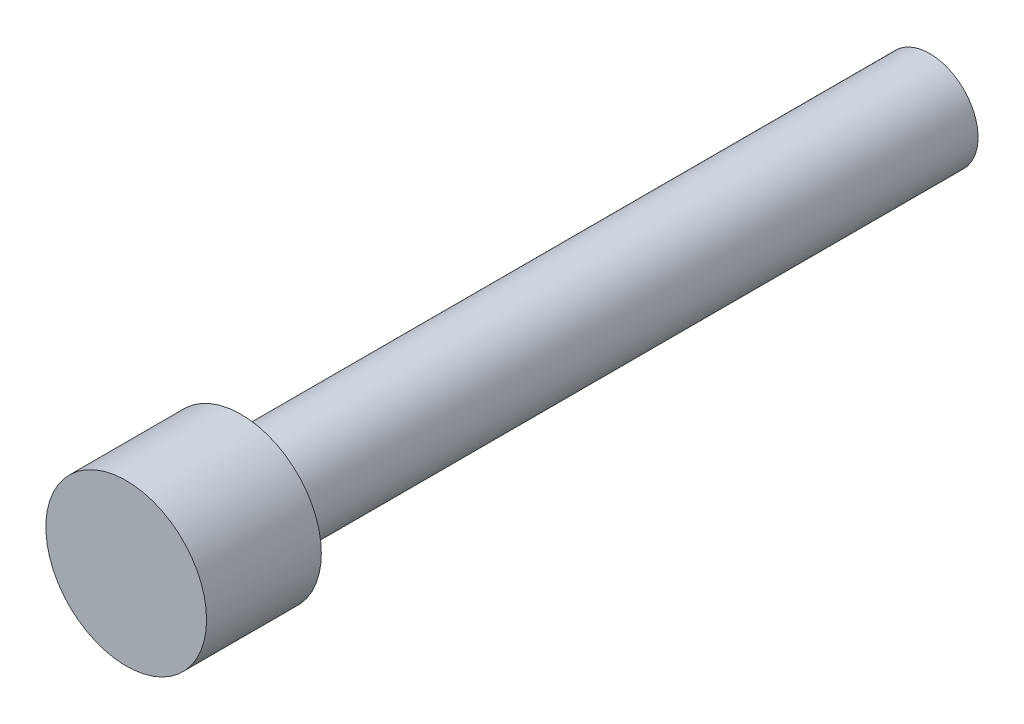
ISO-10303-21;
HEADER;
FILE_DESCRIPTION(('STEP AP214'),'2;1');
FILE_NAME('part.step','',(''),(''),'','','');
FILE_SCHEMA(('AUTOMOTIVE_DESIGN { 1 0 10303 214 1 1 1 1 }'));
ENDSEC;
DATA;
#1=APPLICATION_CONTEXT('core data for automotive mechanical design processes');
#2=APPLICATION_PROTOCOL_DEFINITION('international standard','automotive_design',2000,#1);
#3=PRODUCT_CONTEXT('',#1,'mechanical');
#4=PRODUCT('Part','Part','',(#3));
#5=PRODUCT_RELATED_PRODUCT_CATEGORY('part','',(#4));
#6=PRODUCT_DEFINITION_FORMATION('','',#4);
#7=PRODUCT_DEFINITION_CONTEXT('part definition',#1,'design');
#8=PRODUCT_DEFINITION('design','',#6,#7);
#9=PRODUCT_DEFINITION_SHAPE('','',#8);
#10=(LENGTH_UNIT() NAMED_UNIT(*) SI_UNIT(.MILLI.,.METRE.));
#11=(NAMED_UNIT(*) PLANE_ANGLE_UNIT() SI_UNIT($,.RADIAN.));
#12=(NAMED_UNIT(*) SI_UNIT($,.STERADIAN.) SOLID_ANGLE_UNIT());
#13=UNCERTAINTY_MEASURE_WITH_UNIT(LENGTH_MEASURE(1.E-05),#10,'distance_accuracy_value','');
#14=(GEOMETRIC_REPRESENTATION_CONTEXT(3) GLOBAL_UNCERTAINTY_ASSIGNED_CONTEXT((#13)) GLOBAL_UNIT_ASSIGNED_CONTEXT((#10,
#11,#12)) REPRESENTATION_CONTEXT('',''));
#15=CARTESIAN_POINT('',(0.,0.,0.));
#16=DIRECTION('',(0.,0.,1.));
#17=DIRECTION('',(1.,0.,0.));
#18=AXIS2_PLACEMENT_3D('',#15,#16,#17);
#19=CARTESIAN_POINT('',(0.,0.,19.05));
#20=DIRECTION('',(0.,0.,-1.));
#21=DIRECTION('',(-1.,0.,0.));
#22=AXIS2_PLACEMENT_3D('',#19,#20,#21);
#23=CYLINDRICAL_SURFACE('',#22,1.337499992);
#24=CARTESIAN_POINT('',(0.,0.,19.05));
#25=DIRECTION('',(0.,0.,1.));
#26=DIRECTION('',(1.,0.,0.));
#27=AXIS2_PLACEMENT_3D('',#24,#25,#26);
#28=CIRCLE('',#27,1.337499992);
#29=CARTESIAN_POINT('',(-1.337499992,0.,19.05));
#30=VERTEX_POINT('',#29);
#31=EDGE_CURVE('E11',#30,#30,#28,.T.);
#32=CARTESIAN_POINT('',(0.,0.,0.));
#33=DIRECTION('',(0.,0.,1.));
#34=DIRECTION('',(1.,0.,0.));
#35=AXIS2_PLACEMENT_3D('',#32,#33,#34);
#36=CIRCLE('',#35,1.337499992);
#37=CARTESIAN_POINT('',(-1.337499992,0.,0.));
#38=VERTEX_POINT('',#37);
#39=EDGE_CURVE('E40',#38,#38,#36,.T.);
#40=CARTESIAN_POINT('',(-1.337499992,0.,19.05));
#41=CARTESIAN_POINT('',(-1.337499992,0.,18.8515625));
#42=CARTESIAN_POINT('',(-1.337499992,0.,18.653125));
#43=CARTESIAN_POINT('',(-1.337499992,0.,18.25625));
#44=CARTESIAN_POINT('',(-1.337499992,0.,18.0578125));
#45=CARTESIAN_POINT('',(-1.337499992,0.,17.6609375));
#46=CARTESIAN_POINT('',(-1.337499992,0.,17.4625));
#47=CARTESIAN_POINT('',(-1.337499992,0.,17.065625));
#48=CARTESIAN_POINT('',(-1.337499992,0.,16.8671875));
#49=CARTESIAN_POINT('',(-1.337499992,0.,16.4703125));
#50=CARTESIAN_POINT('',(-1.337499992,0.,16.271875));
#51=CARTESIAN_POINT('',(-1.337499992,0.,15.875));
#52=CARTESIAN_POINT('',(-1.337499992,0.,15.6765625));
#53=CARTESIAN_POINT('',(-1.337499992,0.,15.2796875));
#54=CARTESIAN_POINT('',(-1.337499992,0.,15.08125));
#55=CARTESIAN_POINT('',(-1.337499992,0.,14.684375));
#56=CARTESIAN_POINT('',(-1.337499992,0.,14.4859375));
#57=CARTESIAN_POINT('',(-1.337499992,0.,14.0890625));
#58=CARTESIAN_POINT('',(-1.337499992,0.,13.890625));
#59=CARTESIAN_POINT('',(-1.337499992,0.,13.49375));
#60=CARTESIAN_POINT('',(-1.337499992,0.,13.2953125));
#61=CARTESIAN_POINT('',(-1.337499992,0.,12.8984375));
#62=CARTESIAN_POINT('',(-1.337499992,0.,12.7));
#63=CARTESIAN_POINT('',(-1.337499992,0.,12.303125));
#64=CARTESIAN_POINT('',(-1.337499992,0.,12.1046875));
#65=CARTESIAN_POINT('',(-1.337499992,0.,11.7078125));
#66=CARTESIAN_POINT('',(-1.337499992,0.,11.509375));
#67=CARTESIAN_POINT('',(-1.337499992,0.,11.1125));
#68=CARTESIAN_POINT('',(-1.337499992,0.,10.9140625));
#69=CARTESIAN_POINT('',(-1.337499992,0.,10.5171875));
#70=CARTESIAN_POINT('',(-1.337499992,0.,10.31875));
#71=CARTESIAN_POINT('',(-1.337499992,0.,9.921875));
#72=CARTESIAN_POINT('',(-1.337499992,0.,9.7234375));
#73=CARTESIAN_POINT('',(-1.337499992,0.,9.3265625));
#74=CARTESIAN_POINT('',(-1.337499992,0.,9.128125));
#75=CARTESIAN_POINT('',(-1.337499992,0.,8.73125));
#76=CARTESIAN_POINT('',(-1.337499992,0.,8.5328125));
#77=CARTESIAN_POINT('',(-1.337499992,0.,8.1359375));
#78=CARTESIAN_POINT('',(-1.337499992,0.,7.9375));
#79=CARTESIAN_POINT('',(-1.337499992,0.,7.540625));
#80=CARTESIAN_POINT('',(-1.337499992,0.,7.3421875));
#81=CARTESIAN_POINT('',(-1.337499992,0.,6.9453125));
#82=CARTESIAN_POINT('',(-1.337499992,0.,6.746875));
#83=CARTESIAN_POINT('',(-1.337499992,0.,6.35));
#84=CARTESIAN_POINT('',(-1.337499992,0.,6.1515625));
#85=CARTESIAN_POINT('',(-1.337499992,0.,5.7546875));
#86=CARTESIAN_POINT('',(-1.337499992,0.,5.55625));
#87=CARTESIAN_POINT('',(-1.337499992,0.,5.159375));
#88=CARTESIAN_POINT('',(-1.337499992,0.,4.9609375));
#89=CARTESIAN_POINT('',(-1.337499992,0.,4.5640625));
#90=CARTESIAN_POINT('',(-1.337499992,0.,4.365625));
#91=CARTESIAN_POINT('',(-1.337499992,0.,3.96875));
#92=CARTESIAN_POINT('',(-1.337499992,0.,3.7703125));
#93=CARTESIAN_POINT('',(-1.337499992,0.,3.3734375));
#94=CARTESIAN_POINT('',(-1.337499992,0.,3.175));
#95=CARTESIAN_POINT('',(-1.337499992,0.,2.778125));
#96=CARTESIAN_POINT('',(-1.337499992,0.,2.5796875));
#97=CARTESIAN_POINT('',(-1.337499992,0.,2.1828125));
#98=CARTESIAN_POINT('',(-1.337499992,0.,1.984375));
#99=CARTESIAN_POINT('',(-1.337499992,0.,1.5875));
#100=CARTESIAN_POINT('',(-1.337499992,0.,1.3890625));
#101=CARTESIAN_POINT('',(-1.337499992,0.,0.992187500000001));
#102=CARTESIAN_POINT('',(-1.337499992,0.,0.793750000000001));
#103=CARTESIAN_POINT('',(-1.337499992,0.,0.396875));
#104=CARTESIAN_POINT('',(-1.337499992,0.,0.1984375));
#105=CARTESIAN_POINT('',(-1.337499992,0.,0.));
#106=B_SPLINE_CURVE_WITH_KNOTS('',3,(#40,#41,#42,#43,#44,#45,#46,#47,#48,#49,#50,#51,#52,#53,
#54,#55,#56,#57,#58,#59,#60,#61,#62,#63,#64,#65,#66,#67,#68,#69,#70,#71,#72,#73,#74,#75,#76,#77,
#78,#79,#80,#81,#82,#83,#84,#85,#86,#87,#88,#89,#90,#91,#92,#93,#94,#95,#96,#97,#98,#99,#100,
#101,#102,#103,#104,#105),.UNSPECIFIED.,.F.,.F.,(4,2,2,2,2,2,2,2,2,2,2,2,2,2,2,2,2,2,2,2,2,2,2,
2,2,2,2,2,2,2,2,2,4),(0.,0.5953125,1.190625,1.7859375,2.38125,2.9765625,3.571875,4.1671875,
4.7625,5.3578125,5.953125,6.5484375,7.14375,7.7390625,8.334375,8.9296875,9.525,10.1203125,
10.715625,11.3109375,11.90625,12.5015625,13.096875,13.6921875,14.2875,14.8828125,15.478125,
16.0734375,16.66875,17.2640625,17.859375,18.4546875,19.05),.UNSPECIFIED.);
#107=EDGE_CURVE('BSEAM37',#30,#38,#106,.T.);
#108=ORIENTED_EDGE('',*,*,#31,.F.);
#109=ORIENTED_EDGE('',*,*,#39,.T.);
#110=ORIENTED_EDGE('',*,*,#107,.T.);
#111=ORIENTED_EDGE('',*,*,#107,.F.);
#112=EDGE_LOOP('',(#108,#110,#109,#111));
#113=FACE_BOUND('',#112,.T.);
#114=ADVANCED_FACE('F37',(#113),#23,.T.);
#115=CARTESIAN_POINT('',(0.,0.,0.));
#116=DIRECTION('',(0.,0.,1.));
#117=DIRECTION('',(1.,0.,0.));
#118=AXIS2_PLACEMENT_3D('',#115,#116,#117);
#119=PLANE('',#118);
#120=ORIENTED_EDGE('',*,*,#39,.F.);
#121=EDGE_LOOP('',(#120));
#122=FACE_BOUND('',#121,.T.);
#123=ADVANCED_FACE('F64',(#122),#119,.F.);
#124=CARTESIAN_POINT('',(0.,0.,22.225));
#125=DIRECTION('',(0.,0.,-1.));
#126=DIRECTION('',(-1.,0.,0.));
#127=AXIS2_PLACEMENT_3D('',#124,#125,#126);
#128=CYLINDRICAL_SURFACE('',#127,2.2225);
#129=CARTESIAN_POINT('',(0.,0.,22.225));
#130=DIRECTION('',(0.,0.,1.));
#131=DIRECTION('',(1.,0.,0.));
#132=AXIS2_PLACEMENT_3D('',#129,#130,#131);
#133=CIRCLE('',#132,2.2225);
#134=CARTESIAN_POINT('',(2.2225,0.,22.225));
#135=VERTEX_POINT('',#134);
#136=EDGE_CURVE('E49',#135,#135,#133,.T.);
#137=ORIENTED_EDGE('',*,*,#136,.F.);
#138=EDGE_LOOP('',(#137));
#139=FACE_BOUND('',#138,.T.);
#140=CARTESIAN_POINT('',(0.,0.,19.05));
#141=DIRECTION('',(0.,0.,1.));
#142=DIRECTION('',(1.,0.,0.));
#143=AXIS2_PLACEMENT_3D('',#140,#141,#142);
#144=CIRCLE('',#143,2.2225);
#145=CARTESIAN_POINT('',(2.2225,0.,19.05));
#146=VERTEX_POINT('',#145);
#147=EDGE_CURVE('E51',#146,#146,#144,.T.);
#148=ORIENTED_EDGE('',*,*,#147,.T.);
#149=EDGE_LOOP('',(#148));
#150=FACE_BOUND('',#149,.T.);
#151=ADVANCED_FACE('F61',(#139,#150),#128,.T.);
#152=CARTESIAN_POINT('',(0.,0.,22.225));
#153=DIRECTION('',(0.,0.,1.));
#154=DIRECTION('',(1.,0.,0.));
#155=AXIS2_PLACEMENT_3D('',#152,#153,#154);
#156=PLANE('',#155);
#157=ORIENTED_EDGE('',*,*,#136,.T.);
#158=EDGE_LOOP('',(#157));
#159=FACE_BOUND('',#158,.T.);
#160=ADVANCED_FACE('F59',(#159),#156,.T.);
#161=CARTESIAN_POINT('',(0.,0.,19.05));
#162=DIRECTION('',(0.,0.,1.));
#163=DIRECTION('',(1.,0.,0.));
#164=AXIS2_PLACEMENT_3D('',#161,#162,#163);
#165=PLANE('',#164);
#166=ORIENTED_EDGE('',*,*,#31,.T.);
#167=EDGE_LOOP('',(#166));
#168=FACE_BOUND('',#167,.T.);
#169=ORIENTED_EDGE('',*,*,#147,.F.);
#170=EDGE_LOOP('',(#169));
#171=FACE_BOUND('',#170,.T.);
#172=ADVANCED_FACE('F68',(#168,#171),#165,.F.);
#173=CLOSED_SHELL('',(#114,#123,#151,#160,#172));
#174=MANIFOLD_SOLID_BREP('B2',#173);
#175=ADVANCED_BREP_SHAPE_REPRESENTATION('',(#18,#174),#14);
#176=SHAPE_DEFINITION_REPRESENTATION(#9,#175);
ENDSEC;
END-ISO-10303-21;
